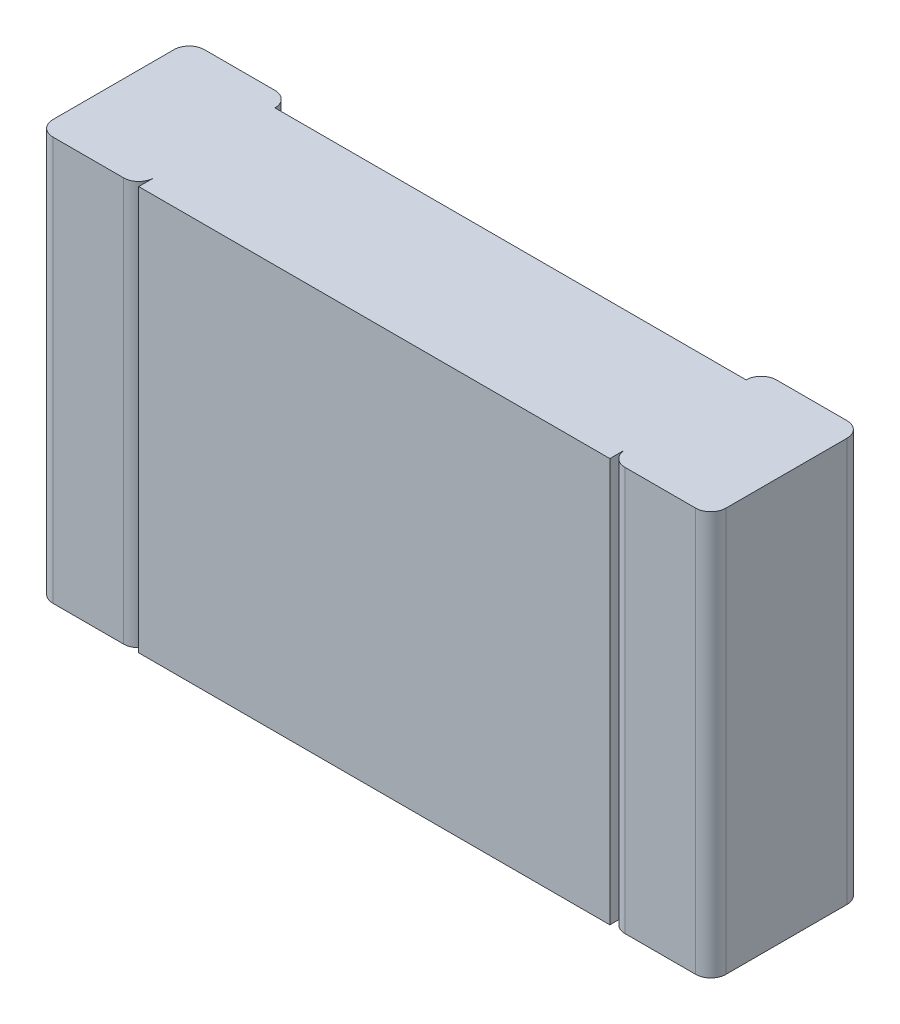
ISO-10303-21;
HEADER;
FILE_DESCRIPTION(('STEP AP214'),'2;1');
FILE_NAME('part.step','',(''),(''),'','','');
FILE_SCHEMA(('AUTOMOTIVE_DESIGN { 1 0 10303 214 1 1 1 1 }'));
ENDSEC;
DATA;
#1=APPLICATION_CONTEXT('core data for automotive mechanical design processes');
#2=APPLICATION_PROTOCOL_DEFINITION('international standard','automotive_design',2000,#1);
#3=PRODUCT_CONTEXT('',#1,'mechanical');
#4=PRODUCT('Part','Part','',(#3));
#5=PRODUCT_RELATED_PRODUCT_CATEGORY('part','',(#4));
#6=PRODUCT_DEFINITION_FORMATION('','',#4);
#7=PRODUCT_DEFINITION_CONTEXT('part definition',#1,'design');
#8=PRODUCT_DEFINITION('design','',#6,#7);
#9=PRODUCT_DEFINITION_SHAPE('','',#8);
#10=(LENGTH_UNIT() NAMED_UNIT(*) SI_UNIT(.MILLI.,.METRE.));
#11=(NAMED_UNIT(*) PLANE_ANGLE_UNIT() SI_UNIT($,.RADIAN.));
#12=(NAMED_UNIT(*) SI_UNIT($,.STERADIAN.) SOLID_ANGLE_UNIT());
#13=UNCERTAINTY_MEASURE_WITH_UNIT(LENGTH_MEASURE(1.E-05),#10,'distance_accuracy_value','');
#14=(GEOMETRIC_REPRESENTATION_CONTEXT(3) GLOBAL_UNCERTAINTY_ASSIGNED_CONTEXT((#13)) GLOBAL_UNIT_ASSIGNED_CONTEXT((#10,
#11,#12)) REPRESENTATION_CONTEXT('',''));
#15=CARTESIAN_POINT('',(0.,0.,0.));
#16=DIRECTION('',(0.,0.,1.));
#17=DIRECTION('',(1.,0.,0.));
#18=AXIS2_PLACEMENT_3D('',#15,#16,#17);
#19=CARTESIAN_POINT('',(-0.955,-0.6,0.045));
#20=DIRECTION('',(0.,1.,0.));
#21=DIRECTION('',(0.,0.,1.));
#22=AXIS2_PLACEMENT_3D('',#19,#20,#21);
#23=CYLINDRICAL_SURFACE('',#22,0.045);
#24=DIRECTION('',(0.,1.,0.));
#25=VECTOR('',#24,1.);
#26=CARTESIAN_POINT('',(-0.955,-0.6,0.));
#27=LINE('',#26,#25);
#28=CARTESIAN_POINT('',(-0.955,0.6,0.));
#29=VERTEX_POINT('',#28);
#30=CARTESIAN_POINT('',(-0.955,-0.6,0.));
#31=VERTEX_POINT('',#30);
#32=EDGE_CURVE('E163',#29,#31,#27,.F.);
#33=ORIENTED_EDGE('',*,*,#32,.T.);
#34=CARTESIAN_POINT('',(-0.955,-0.6,0.045));
#35=DIRECTION('',(0.,1.,0.));
#36=DIRECTION('',(0.,0.,1.));
#37=AXIS2_PLACEMENT_3D('',#34,#35,#36);
#38=CIRCLE('',#37,0.045);
#39=CARTESIAN_POINT('',(-1.,-0.6,0.045));
#40=VERTEX_POINT('',#39);
#41=EDGE_CURVE('E20',#31,#40,#38,.T.);
#42=ORIENTED_EDGE('',*,*,#41,.T.);
#43=DIRECTION('',(0.,1.,0.));
#44=VECTOR('',#43,1.);
#45=CARTESIAN_POINT('',(-1.,-0.6,0.045));
#46=LINE('',#45,#44);
#47=CARTESIAN_POINT('',(-1.,0.6,0.045));
#48=VERTEX_POINT('',#47);
#49=EDGE_CURVE('E170',#40,#48,#46,.T.);
#50=ORIENTED_EDGE('',*,*,#49,.T.);
#51=CARTESIAN_POINT('',(-0.955,0.6,0.045));
#52=DIRECTION('',(0.,1.,0.));
#53=DIRECTION('',(0.,0.,1.));
#54=AXIS2_PLACEMENT_3D('',#51,#52,#53);
#55=CIRCLE('',#54,0.045);
#56=EDGE_CURVE('E296',#29,#48,#55,.T.);
#57=ORIENTED_EDGE('',*,*,#56,.F.);
#58=EDGE_LOOP('',(#33,#42,#50,#57));
#59=FACE_BOUND('',#58,.T.);
#60=ADVANCED_FACE('F17',(#59),#23,.T.);
#61=CARTESIAN_POINT('',(-1.,-0.6,0.));
#62=DIRECTION('',(1.,0.,0.));
#63=DIRECTION('',(0.,0.,-1.));
#64=AXIS2_PLACEMENT_3D('',#61,#62,#63);
#65=PLANE('',#64);
#66=DIRECTION('',(0.,0.,1.));
#67=VECTOR('',#66,1.);
#68=CARTESIAN_POINT('',(-1.,0.6,0.));
#69=LINE('',#68,#67);
#70=CARTESIAN_POINT('',(-1.,0.6,0.405));
#71=VERTEX_POINT('',#70);
#72=EDGE_CURVE('E175',#48,#71,#69,.T.);
#73=ORIENTED_EDGE('',*,*,#72,.F.);
#74=ORIENTED_EDGE('',*,*,#49,.F.);
#75=DIRECTION('',(0.,0.,1.));
#76=VECTOR('',#75,1.);
#77=CARTESIAN_POINT('',(-1.,-0.6,0.));
#78=LINE('',#77,#76);
#79=CARTESIAN_POINT('',(-1.,-0.6,0.405));
#80=VERTEX_POINT('',#79);
#81=EDGE_CURVE('E174',#40,#80,#78,.T.);
#82=ORIENTED_EDGE('',*,*,#81,.T.);
#83=DIRECTION('',(0.,1.,0.));
#84=VECTOR('',#83,1.);
#85=CARTESIAN_POINT('',(-1.,-0.6,0.405));
#86=LINE('',#85,#84);
#87=EDGE_CURVE('E177',#71,#80,#86,.F.);
#88=ORIENTED_EDGE('',*,*,#87,.F.);
#89=EDGE_LOOP('',(#73,#74,#82,#88));
#90=FACE_BOUND('',#89,.T.);
#91=ADVANCED_FACE('F172',(#90),#65,.F.);
#92=CARTESIAN_POINT('',(-0.955,-0.6,0.405));
#93=DIRECTION('',(0.,1.,0.));
#94=DIRECTION('',(0.,0.,1.));
#95=AXIS2_PLACEMENT_3D('',#92,#93,#94);
#96=CYLINDRICAL_SURFACE('',#95,0.045);
#97=CARTESIAN_POINT('',(-0.955,0.6,0.405));
#98=DIRECTION('',(0.,1.,0.));
#99=DIRECTION('',(0.,0.,1.));
#100=AXIS2_PLACEMENT_3D('',#97,#98,#99);
#101=CIRCLE('',#100,0.045);
#102=CARTESIAN_POINT('',(-0.955,0.6,0.45));
#103=VERTEX_POINT('',#102);
#104=EDGE_CURVE('E293',#71,#103,#101,.T.);
#105=ORIENTED_EDGE('',*,*,#104,.F.);
#106=ORIENTED_EDGE('',*,*,#87,.T.);
#107=CARTESIAN_POINT('',(-0.955,-0.6,0.405));
#108=DIRECTION('',(0.,1.,0.));
#109=DIRECTION('',(0.,0.,1.));
#110=AXIS2_PLACEMENT_3D('',#107,#108,#109);
#111=CIRCLE('',#110,0.045);
#112=CARTESIAN_POINT('',(-0.955,-0.6,0.45));
#113=VERTEX_POINT('',#112);
#114=EDGE_CURVE('E186',#80,#113,#111,.T.);
#115=ORIENTED_EDGE('',*,*,#114,.T.);
#116=DIRECTION('',(0.,1.,0.));
#117=VECTOR('',#116,1.);
#118=CARTESIAN_POINT('',(-0.955,-0.6,0.45));
#119=LINE('',#118,#117);
#120=EDGE_CURVE('E252',#103,#113,#119,.F.);
#121=ORIENTED_EDGE('',*,*,#120,.F.);
#122=EDGE_LOOP('',(#105,#106,#115,#121));
#123=FACE_BOUND('',#122,.T.);
#124=ADVANCED_FACE('F545',(#123),#96,.T.);
#125=CARTESIAN_POINT('',(-1.,-0.6,0.45));
#126=DIRECTION('',(0.,0.,1.));
#127=DIRECTION('',(1.,0.,0.));
#128=AXIS2_PLACEMENT_3D('',#125,#126,#127);
#129=PLANE('',#128);
#130=DIRECTION('',(1.,0.,0.));
#131=VECTOR('',#130,1.);
#132=CARTESIAN_POINT('',(-1.,-0.6,0.45));
#133=LINE('',#132,#131);
#134=CARTESIAN_POINT('',(-0.745,-0.6,0.45));
#135=VERTEX_POINT('',#134);
#136=EDGE_CURVE('E317',#113,#135,#133,.T.);
#137=ORIENTED_EDGE('',*,*,#136,.T.);
#138=DIRECTION('',(0.,1.,0.));
#139=VECTOR('',#138,1.);
#140=CARTESIAN_POINT('',(-0.745,-0.6,0.45));
#141=LINE('',#140,#139);
#142=CARTESIAN_POINT('',(-0.745,0.6,0.45));
#143=VERTEX_POINT('',#142);
#144=EDGE_CURVE('E249',#143,#135,#141,.F.);
#145=ORIENTED_EDGE('',*,*,#144,.F.);
#146=DIRECTION('',(1.,0.,0.));
#147=VECTOR('',#146,1.);
#148=CARTESIAN_POINT('',(-1.,0.6,0.45));
#149=LINE('',#148,#147);
#150=EDGE_CURVE('E292',#103,#143,#149,.T.);
#151=ORIENTED_EDGE('',*,*,#150,.F.);
#152=ORIENTED_EDGE('',*,*,#120,.T.);
#153=EDGE_LOOP('',(#137,#145,#151,#152));
#154=FACE_BOUND('',#153,.T.);
#155=ADVANCED_FACE('F535',(#154),#129,.T.);
#156=CARTESIAN_POINT('',(-0.745,-0.6,0.405));
#157=DIRECTION('',(0.,1.,0.));
#158=DIRECTION('',(0.,0.,1.));
#159=AXIS2_PLACEMENT_3D('',#156,#157,#158);
#160=CYLINDRICAL_SURFACE('',#159,0.045);
#161=ORIENTED_EDGE('',*,*,#144,.T.);
#162=CARTESIAN_POINT('',(-0.745,-0.6,0.405));
#163=DIRECTION('',(0.,1.,0.));
#164=DIRECTION('',(0.,0.,1.));
#165=AXIS2_PLACEMENT_3D('',#162,#163,#164);
#166=CIRCLE('',#165,0.045);
#167=CARTESIAN_POINT('',(-0.7,-0.6,0.405));
#168=VERTEX_POINT('',#167);
#169=EDGE_CURVE('E314',#135,#168,#166,.T.);
#170=ORIENTED_EDGE('',*,*,#169,.T.);
#171=DIRECTION('',(0.,1.,0.));
#172=VECTOR('',#171,1.);
#173=CARTESIAN_POINT('',(-0.7,-0.6,0.405));
#174=LINE('',#173,#172);
#175=CARTESIAN_POINT('',(-0.7,0.6,0.405));
#176=VERTEX_POINT('',#175);
#177=EDGE_CURVE('E243',#168,#176,#174,.T.);
#178=ORIENTED_EDGE('',*,*,#177,.T.);
#179=CARTESIAN_POINT('',(-0.745,0.6,0.405));
#180=DIRECTION('',(0.,1.,0.));
#181=DIRECTION('',(0.,0.,1.));
#182=AXIS2_PLACEMENT_3D('',#179,#180,#181);
#183=CIRCLE('',#182,0.045);
#184=EDGE_CURVE('E289',#143,#176,#183,.T.);
#185=ORIENTED_EDGE('',*,*,#184,.F.);
#186=EDGE_LOOP('',(#161,#170,#178,#185));
#187=FACE_BOUND('',#186,.T.);
#188=ADVANCED_FACE('F523',(#187),#160,.T.);
#189=CARTESIAN_POINT('',(-0.7,-0.6,0.405));
#190=DIRECTION('',(1.,0.,0.));
#191=DIRECTION('',(0.,0.,-1.));
#192=AXIS2_PLACEMENT_3D('',#189,#190,#191);
#193=PLANE('',#192);
#194=DIRECTION('',(0.,0.,1.));
#195=VECTOR('',#194,1.);
#196=CARTESIAN_POINT('',(-0.7,0.6,0.405));
#197=LINE('',#196,#195);
#198=CARTESIAN_POINT('',(-0.7,0.6,0.45));
#199=VERTEX_POINT('',#198);
#200=EDGE_CURVE('E237',#176,#199,#197,.T.);
#201=ORIENTED_EDGE('',*,*,#200,.F.);
#202=ORIENTED_EDGE('',*,*,#177,.F.);
#203=DIRECTION('',(0.,0.,1.));
#204=VECTOR('',#203,1.);
#205=CARTESIAN_POINT('',(-0.7,-0.6,0.405));
#206=LINE('',#205,#204);
#207=CARTESIAN_POINT('',(-0.7,-0.6,0.45));
#208=VERTEX_POINT('',#207);
#209=EDGE_CURVE('E261',#168,#208,#206,.T.);
#210=ORIENTED_EDGE('',*,*,#209,.T.);
#211=DIRECTION('',(0.,1.,0.));
#212=VECTOR('',#211,1.);
#213=CARTESIAN_POINT('',(-0.7,-0.6,0.45));
#214=LINE('',#213,#212);
#215=EDGE_CURVE('E229',#199,#208,#214,.F.);
#216=ORIENTED_EDGE('',*,*,#215,.F.);
#217=EDGE_LOOP('',(#201,#202,#210,#216));
#218=FACE_BOUND('',#217,.T.);
#219=ADVANCED_FACE('F513',(#218),#193,.F.);
#220=CARTESIAN_POINT('',(-0.7,-0.6,0.45));
#221=DIRECTION('',(0.,0.,1.));
#222=DIRECTION('',(1.,0.,0.));
#223=AXIS2_PLACEMENT_3D('',#220,#221,#222);
#224=PLANE('',#223);
#225=DIRECTION('',(0.,1.,0.));
#226=VECTOR('',#225,1.);
#227=CARTESIAN_POINT('',(0.7,-0.6,0.45));
#228=LINE('',#227,#226);
#229=CARTESIAN_POINT('',(0.7,0.6,0.45));
#230=VERTEX_POINT('',#229);
#231=CARTESIAN_POINT('',(0.7,-0.6,0.45));
#232=VERTEX_POINT('',#231);
#233=EDGE_CURVE('E220',#230,#232,#228,.F.);
#234=ORIENTED_EDGE('',*,*,#233,.F.);
#235=DIRECTION('',(1.,0.,0.));
#236=VECTOR('',#235,1.);
#237=CARTESIAN_POINT('',(-0.7,0.6,0.45));
#238=LINE('',#237,#236);
#239=EDGE_CURVE('E232',#199,#230,#238,.T.);
#240=ORIENTED_EDGE('',*,*,#239,.F.);
#241=ORIENTED_EDGE('',*,*,#215,.T.);
#242=DIRECTION('',(1.,0.,0.));
#243=VECTOR('',#242,1.);
#244=CARTESIAN_POINT('',(-0.7,-0.6,0.45));
#245=LINE('',#244,#243);
#246=EDGE_CURVE('E257',#208,#232,#245,.T.);
#247=ORIENTED_EDGE('',*,*,#246,.T.);
#248=EDGE_LOOP('',(#234,#240,#241,#247));
#249=FACE_BOUND('',#248,.T.);
#250=ADVANCED_FACE('F500',(#249),#224,.T.);
#251=CARTESIAN_POINT('',(0.7,-0.6,0.405));
#252=DIRECTION('',(1.,0.,0.));
#253=DIRECTION('',(0.,0.,-1.));
#254=AXIS2_PLACEMENT_3D('',#251,#252,#253);
#255=PLANE('',#254);
#256=DIRECTION('',(0.,0.,1.));
#257=VECTOR('',#256,1.);
#258=CARTESIAN_POINT('',(0.7,0.6,0.405));
#259=LINE('',#258,#257);
#260=CARTESIAN_POINT('',(0.7,0.6,0.405));
#261=VERTEX_POINT('',#260);
#262=EDGE_CURVE('E236',#230,#261,#259,.F.);
#263=ORIENTED_EDGE('',*,*,#262,.F.);
#264=ORIENTED_EDGE('',*,*,#233,.T.);
#265=DIRECTION('',(0.,0.,1.));
#266=VECTOR('',#265,1.);
#267=CARTESIAN_POINT('',(0.7,-0.6,0.405));
#268=LINE('',#267,#266);
#269=CARTESIAN_POINT('',(0.7,-0.6,0.405));
#270=VERTEX_POINT('',#269);
#271=EDGE_CURVE('E225',#232,#270,#268,.F.);
#272=ORIENTED_EDGE('',*,*,#271,.T.);
#273=DIRECTION('',(0.,1.,0.));
#274=VECTOR('',#273,1.);
#275=CARTESIAN_POINT('',(0.7,-0.6,0.405));
#276=LINE('',#275,#274);
#277=EDGE_CURVE('E217',#261,#270,#276,.F.);
#278=ORIENTED_EDGE('',*,*,#277,.F.);
#279=EDGE_LOOP('',(#263,#264,#272,#278));
#280=FACE_BOUND('',#279,.T.);
#281=ADVANCED_FACE('F468',(#280),#255,.T.);
#282=CARTESIAN_POINT('',(0.745,-0.6,0.405));
#283=DIRECTION('',(0.,1.,0.));
#284=DIRECTION('',(0.,0.,1.));
#285=AXIS2_PLACEMENT_3D('',#282,#283,#284);
#286=CYLINDRICAL_SURFACE('',#285,0.045);
#287=CARTESIAN_POINT('',(0.745,0.6,0.405));
#288=DIRECTION('',(0.,1.,0.));
#289=DIRECTION('',(0.,0.,1.));
#290=AXIS2_PLACEMENT_3D('',#287,#288,#289);
#291=CIRCLE('',#290,0.045);
#292=CARTESIAN_POINT('',(0.745,0.6,0.45));
#293=VERTEX_POINT('',#292);
#294=EDGE_CURVE('E285',#261,#293,#291,.T.);
#295=ORIENTED_EDGE('',*,*,#294,.F.);
#296=ORIENTED_EDGE('',*,*,#277,.T.);
#297=CARTESIAN_POINT('',(0.745,-0.6,0.405));
#298=DIRECTION('',(0.,1.,0.));
#299=DIRECTION('',(0.,0.,1.));
#300=AXIS2_PLACEMENT_3D('',#297,#298,#299);
#301=CIRCLE('',#300,0.045);
#302=CARTESIAN_POINT('',(0.745,-0.6,0.45));
#303=VERTEX_POINT('',#302);
#304=EDGE_CURVE('E310',#270,#303,#301,.T.);
#305=ORIENTED_EDGE('',*,*,#304,.T.);
#306=DIRECTION('',(0.,1.,0.));
#307=VECTOR('',#306,1.);
#308=CARTESIAN_POINT('',(0.745,-0.6,0.45));
#309=LINE('',#308,#307);
#310=EDGE_CURVE('E214',#293,#303,#309,.F.);
#311=ORIENTED_EDGE('',*,*,#310,.F.);
#312=EDGE_LOOP('',(#295,#296,#305,#311));
#313=FACE_BOUND('',#312,.T.);
#314=ADVANCED_FACE('F499',(#313),#286,.T.);
#315=CARTESIAN_POINT('',(0.7,-0.6,0.45));
#316=DIRECTION('',(0.,0.,1.));
#317=DIRECTION('',(1.,0.,0.));
#318=AXIS2_PLACEMENT_3D('',#315,#316,#317);
#319=PLANE('',#318);
#320=DIRECTION('',(1.,0.,0.));
#321=VECTOR('',#320,1.);
#322=CARTESIAN_POINT('',(0.7,-0.6,0.45));
#323=LINE('',#322,#321);
#324=CARTESIAN_POINT('',(0.955,-0.6,0.45));
#325=VERTEX_POINT('',#324);
#326=EDGE_CURVE('E309',#303,#325,#323,.T.);
#327=ORIENTED_EDGE('',*,*,#326,.T.);
#328=DIRECTION('',(0.,1.,0.));
#329=VECTOR('',#328,1.);
#330=CARTESIAN_POINT('',(0.955,-0.6,0.45));
#331=LINE('',#330,#329);
#332=CARTESIAN_POINT('',(0.955,0.6,0.45));
#333=VERTEX_POINT('',#332);
#334=EDGE_CURVE('E211',#333,#325,#331,.F.);
#335=ORIENTED_EDGE('',*,*,#334,.F.);
#336=DIRECTION('',(1.,0.,0.));
#337=VECTOR('',#336,1.);
#338=CARTESIAN_POINT('',(0.7,0.6,0.45));
#339=LINE('',#338,#337);
#340=EDGE_CURVE('E284',#293,#333,#339,.T.);
#341=ORIENTED_EDGE('',*,*,#340,.F.);
#342=ORIENTED_EDGE('',*,*,#310,.T.);
#343=EDGE_LOOP('',(#327,#335,#341,#342));
#344=FACE_BOUND('',#343,.T.);
#345=ADVANCED_FACE('F613',(#344),#319,.T.);
#346=CARTESIAN_POINT('',(0.955,-0.6,0.405));
#347=DIRECTION('',(0.,1.,0.));
#348=DIRECTION('',(0.,0.,1.));
#349=AXIS2_PLACEMENT_3D('',#346,#347,#348);
#350=CYLINDRICAL_SURFACE('',#349,0.045);
#351=ORIENTED_EDGE('',*,*,#334,.T.);
#352=CARTESIAN_POINT('',(0.955,-0.6,0.405));
#353=DIRECTION('',(0.,1.,0.));
#354=DIRECTION('',(0.,0.,1.));
#355=AXIS2_PLACEMENT_3D('',#352,#353,#354);
#356=CIRCLE('',#355,0.045);
#357=CARTESIAN_POINT('',(1.,-0.6,0.405));
#358=VERTEX_POINT('',#357);
#359=EDGE_CURVE('E305',#325,#358,#356,.T.);
#360=ORIENTED_EDGE('',*,*,#359,.T.);
#361=DIRECTION('',(0.,1.,0.));
#362=VECTOR('',#361,1.);
#363=CARTESIAN_POINT('',(1.,-0.6,0.405));
#364=LINE('',#363,#362);
#365=CARTESIAN_POINT('',(1.,0.6,0.405));
#366=VERTEX_POINT('',#365);
#367=EDGE_CURVE('E208',#366,#358,#364,.F.);
#368=ORIENTED_EDGE('',*,*,#367,.F.);
#369=CARTESIAN_POINT('',(0.955,0.6,0.405));
#370=DIRECTION('',(0.,1.,0.));
#371=DIRECTION('',(0.,0.,1.));
#372=AXIS2_PLACEMENT_3D('',#369,#370,#371);
#373=CIRCLE('',#372,0.045);
#374=EDGE_CURVE('E281',#333,#366,#373,.T.);
#375=ORIENTED_EDGE('',*,*,#374,.F.);
#376=EDGE_LOOP('',(#351,#360,#368,#375));
#377=FACE_BOUND('',#376,.T.);
#378=ADVANCED_FACE('F576',(#377),#350,.T.);
#379=CARTESIAN_POINT('',(1.,-0.6,0.));
#380=DIRECTION('',(1.,0.,0.));
#381=DIRECTION('',(0.,0.,-1.));
#382=AXIS2_PLACEMENT_3D('',#379,#380,#381);
#383=PLANE('',#382);
#384=DIRECTION('',(0.,0.,1.));
#385=VECTOR('',#384,1.);
#386=CARTESIAN_POINT('',(1.,0.6,0.));
#387=LINE('',#386,#385);
#388=CARTESIAN_POINT('',(1.,0.6,0.045));
#389=VERTEX_POINT('',#388);
#390=EDGE_CURVE('E280',#366,#389,#387,.F.);
#391=ORIENTED_EDGE('',*,*,#390,.F.);
#392=ORIENTED_EDGE('',*,*,#367,.T.);
#393=DIRECTION('',(0.,0.,1.));
#394=VECTOR('',#393,1.);
#395=CARTESIAN_POINT('',(1.,-0.6,0.));
#396=LINE('',#395,#394);
#397=CARTESIAN_POINT('',(1.,-0.6,0.045));
#398=VERTEX_POINT('',#397);
#399=EDGE_CURVE('E304',#358,#398,#396,.F.);
#400=ORIENTED_EDGE('',*,*,#399,.T.);
#401=DIRECTION('',(0.,1.,0.));
#402=VECTOR('',#401,1.);
#403=CARTESIAN_POINT('',(1.,-0.6,0.045));
#404=LINE('',#403,#402);
#405=EDGE_CURVE('E198',#389,#398,#404,.F.);
#406=ORIENTED_EDGE('',*,*,#405,.F.);
#407=EDGE_LOOP('',(#391,#392,#400,#406));
#408=FACE_BOUND('',#407,.T.);
#409=ADVANCED_FACE('F386',(#408),#383,.T.);
#410=CARTESIAN_POINT('',(0.955,-0.6,0.045));
#411=DIRECTION('',(0.,1.,0.));
#412=DIRECTION('',(0.,0.,1.));
#413=AXIS2_PLACEMENT_3D('',#410,#411,#412);
#414=CYLINDRICAL_SURFACE('',#413,0.045);
#415=CARTESIAN_POINT('',(0.955,0.6,0.045));
#416=DIRECTION('',(0.,1.,0.));
#417=DIRECTION('',(0.,0.,1.));
#418=AXIS2_PLACEMENT_3D('',#415,#416,#417);
#419=CIRCLE('',#418,0.045);
#420=CARTESIAN_POINT('',(0.955,0.6,0.));
#421=VERTEX_POINT('',#420);
#422=EDGE_CURVE('E276',#389,#421,#419,.T.);
#423=ORIENTED_EDGE('',*,*,#422,.F.);
#424=ORIENTED_EDGE('',*,*,#405,.T.);
#425=CARTESIAN_POINT('',(0.955,-0.6,0.045));
#426=DIRECTION('',(0.,1.,0.));
#427=DIRECTION('',(0.,0.,1.));
#428=AXIS2_PLACEMENT_3D('',#425,#426,#427);
#429=CIRCLE('',#428,0.045);
#430=CARTESIAN_POINT('',(0.955,-0.6,0.));
#431=VERTEX_POINT('',#430);
#432=EDGE_CURVE('E300',#398,#431,#429,.T.);
#433=ORIENTED_EDGE('',*,*,#432,.T.);
#434=DIRECTION('',(0.,1.,0.));
#435=VECTOR('',#434,1.);
#436=CARTESIAN_POINT('',(0.955,-0.6,0.));
#437=LINE('',#436,#435);
#438=EDGE_CURVE('E221',#431,#421,#437,.T.);
#439=ORIENTED_EDGE('',*,*,#438,.T.);
#440=EDGE_LOOP('',(#423,#424,#433,#439));
#441=FACE_BOUND('',#440,.T.);
#442=ADVANCED_FACE('F390',(#441),#414,.T.);
#443=CARTESIAN_POINT('',(-1.,-0.6,0.));
#444=DIRECTION('',(0.,0.,1.));
#445=DIRECTION('',(1.,0.,0.));
#446=AXIS2_PLACEMENT_3D('',#443,#444,#445);
#447=PLANE('',#446);
#448=DIRECTION('',(1.,0.,0.));
#449=VECTOR('',#448,1.);
#450=CARTESIAN_POINT('',(-1.,-0.6,0.));
#451=LINE('',#450,#449);
#452=CARTESIAN_POINT('',(-0.745,-0.6,0.));
#453=VERTEX_POINT('',#452);
#454=EDGE_CURVE('E190',#453,#31,#451,.F.);
#455=ORIENTED_EDGE('',*,*,#454,.T.);
#456=ORIENTED_EDGE('',*,*,#32,.F.);
#457=DIRECTION('',(1.,0.,0.));
#458=VECTOR('',#457,1.);
#459=CARTESIAN_POINT('',(-1.,0.6,0.));
#460=LINE('',#459,#458);
#461=CARTESIAN_POINT('',(-0.745,0.6,0.));
#462=VERTEX_POINT('',#461);
#463=EDGE_CURVE('E299',#462,#29,#460,.F.);
#464=ORIENTED_EDGE('',*,*,#463,.F.);
#465=DIRECTION('',(0.,1.,0.));
#466=VECTOR('',#465,1.);
#467=CARTESIAN_POINT('',(-0.745,-0.6,0.));
#468=LINE('',#467,#466);
#469=EDGE_CURVE('E202',#453,#462,#468,.T.);
#470=ORIENTED_EDGE('',*,*,#469,.F.);
#471=EDGE_LOOP('',(#455,#456,#464,#470));
#472=FACE_BOUND('',#471,.T.);
#473=ADVANCED_FACE('F408',(#472),#447,.F.);
#474=CARTESIAN_POINT('',(0.7,-0.6,0.));
#475=DIRECTION('',(0.,0.,1.));
#476=DIRECTION('',(1.,0.,0.));
#477=AXIS2_PLACEMENT_3D('',#474,#475,#476);
#478=PLANE('',#477);
#479=DIRECTION('',(1.,0.,0.));
#480=VECTOR('',#479,1.);
#481=CARTESIAN_POINT('',(0.7,-0.6,0.));
#482=LINE('',#481,#480);
#483=CARTESIAN_POINT('',(0.745,-0.6,0.));
#484=VERTEX_POINT('',#483);
#485=EDGE_CURVE('E224',#431,#484,#482,.F.);
#486=ORIENTED_EDGE('',*,*,#485,.T.);
#487=DIRECTION('',(0.,1.,0.));
#488=VECTOR('',#487,1.);
#489=CARTESIAN_POINT('',(0.745,-0.6,0.));
#490=LINE('',#489,#488);
#491=CARTESIAN_POINT('',(0.745,0.6,0.));
#492=VERTEX_POINT('',#491);
#493=EDGE_CURVE('E268',#492,#484,#490,.F.);
#494=ORIENTED_EDGE('',*,*,#493,.F.);
#495=DIRECTION('',(1.,0.,0.));
#496=VECTOR('',#495,1.);
#497=CARTESIAN_POINT('',(0.7,0.6,0.));
#498=LINE('',#497,#496);
#499=EDGE_CURVE('E288',#421,#492,#498,.F.);
#500=ORIENTED_EDGE('',*,*,#499,.F.);
#501=ORIENTED_EDGE('',*,*,#438,.F.);
#502=EDGE_LOOP('',(#486,#494,#500,#501));
#503=FACE_BOUND('',#502,.T.);
#504=ADVANCED_FACE('F393',(#503),#478,.F.);
#505=CARTESIAN_POINT('',(-0.745,-0.6,0.045));
#506=DIRECTION('',(0.,1.,0.));
#507=DIRECTION('',(0.,0.,1.));
#508=AXIS2_PLACEMENT_3D('',#505,#506,#507);
#509=CYLINDRICAL_SURFACE('',#508,0.045);
#510=CARTESIAN_POINT('',(-0.745,0.6,0.045));
#511=DIRECTION('',(0.,1.,0.));
#512=DIRECTION('',(0.,0.,1.));
#513=AXIS2_PLACEMENT_3D('',#510,#511,#512);
#514=CIRCLE('',#513,0.045);
#515=CARTESIAN_POINT('',(-0.7,0.6,0.045));
#516=VERTEX_POINT('',#515);
#517=EDGE_CURVE('E204',#462,#516,#514,.F.);
#518=ORIENTED_EDGE('',*,*,#517,.T.);
#519=DIRECTION('',(0.,1.,0.));
#520=VECTOR('',#519,1.);
#521=CARTESIAN_POINT('',(-0.7,-0.6,0.045));
#522=LINE('',#521,#520);
#523=CARTESIAN_POINT('',(-0.7,-0.6,0.045));
#524=VERTEX_POINT('',#523);
#525=EDGE_CURVE('E267',#516,#524,#522,.F.);
#526=ORIENTED_EDGE('',*,*,#525,.T.);
#527=CARTESIAN_POINT('',(-0.745,-0.6,0.045));
#528=DIRECTION('',(0.,1.,0.));
#529=DIRECTION('',(0.,0.,1.));
#530=AXIS2_PLACEMENT_3D('',#527,#528,#529);
#531=CIRCLE('',#530,0.045);
#532=EDGE_CURVE('E205',#524,#453,#531,.T.);
#533=ORIENTED_EDGE('',*,*,#532,.T.);
#534=ORIENTED_EDGE('',*,*,#469,.T.);
#535=EDGE_LOOP('',(#518,#526,#533,#534));
#536=FACE_BOUND('',#535,.T.);
#537=ADVANCED_FACE('F407',(#536),#509,.T.);
#538=CARTESIAN_POINT('',(-0.955,-0.6,0.045));
#539=DIRECTION('',(0.,1.,0.));
#540=DIRECTION('',(0.,0.,1.));
#541=AXIS2_PLACEMENT_3D('',#538,#539,#540);
#542=PLANE('',#541);
#543=DIRECTION('',(1.,0.,0.));
#544=VECTOR('',#543,1.);
#545=CARTESIAN_POINT('',(-0.955,-0.6,0.045));
#546=LINE('',#545,#544);
#547=CARTESIAN_POINT('',(0.7,-0.6,0.045));
#548=VERTEX_POINT('',#547);
#549=EDGE_CURVE('E336',#524,#548,#546,.T.);
#550=ORIENTED_EDGE('',*,*,#549,.T.);
#551=CARTESIAN_POINT('',(0.745,-0.6,0.045));
#552=DIRECTION('',(0.,1.,0.));
#553=DIRECTION('',(0.,0.,1.));
#554=AXIS2_PLACEMENT_3D('',#551,#552,#553);
#555=CIRCLE('',#554,0.045);
#556=EDGE_CURVE('E264',#484,#548,#555,.T.);
#557=ORIENTED_EDGE('',*,*,#556,.F.);
#558=ORIENTED_EDGE('',*,*,#485,.F.);
#559=ORIENTED_EDGE('',*,*,#432,.F.);
#560=ORIENTED_EDGE('',*,*,#399,.F.);
#561=ORIENTED_EDGE('',*,*,#359,.F.);
#562=ORIENTED_EDGE('',*,*,#326,.F.);
#563=ORIENTED_EDGE('',*,*,#304,.F.);
#564=ORIENTED_EDGE('',*,*,#271,.F.);
#565=ORIENTED_EDGE('',*,*,#246,.F.);
#566=ORIENTED_EDGE('',*,*,#209,.F.);
#567=ORIENTED_EDGE('',*,*,#169,.F.);
#568=ORIENTED_EDGE('',*,*,#136,.F.);
#569=ORIENTED_EDGE('',*,*,#114,.F.);
#570=ORIENTED_EDGE('',*,*,#81,.F.);
#571=ORIENTED_EDGE('',*,*,#41,.F.);
#572=ORIENTED_EDGE('',*,*,#454,.F.);
#573=ORIENTED_EDGE('',*,*,#532,.F.);
#574=EDGE_LOOP('',(#550,#557,#558,#559,#560,#561,#562,#563,#564,#565,#566,#567,#568,#569,#570,
#571,#572,#573));
#575=FACE_BOUND('',#574,.T.);
#576=ADVANCED_FACE('F182',(#575),#542,.F.);
#577=CARTESIAN_POINT('',(0.745,-0.6,0.045));
#578=DIRECTION('',(0.,1.,0.));
#579=DIRECTION('',(0.,0.,1.));
#580=AXIS2_PLACEMENT_3D('',#577,#578,#579);
#581=CYLINDRICAL_SURFACE('',#580,0.045);
#582=ORIENTED_EDGE('',*,*,#493,.T.);
#583=ORIENTED_EDGE('',*,*,#556,.T.);
#584=DIRECTION('',(0.,1.,0.));
#585=VECTOR('',#584,1.);
#586=CARTESIAN_POINT('',(0.7,-0.6,0.045));
#587=LINE('',#586,#585);
#588=CARTESIAN_POINT('',(0.7,0.6,0.045));
#589=VERTEX_POINT('',#588);
#590=EDGE_CURVE('E27',#548,#589,#587,.T.);
#591=ORIENTED_EDGE('',*,*,#590,.T.);
#592=CARTESIAN_POINT('',(0.745,0.6,0.045));
#593=DIRECTION('',(0.,1.,0.));
#594=DIRECTION('',(0.,0.,1.));
#595=AXIS2_PLACEMENT_3D('',#592,#593,#594);
#596=CIRCLE('',#595,0.045);
#597=EDGE_CURVE('E39',#589,#492,#596,.F.);
#598=ORIENTED_EDGE('',*,*,#597,.T.);
#599=EDGE_LOOP('',(#582,#583,#591,#598));
#600=FACE_BOUND('',#599,.T.);
#601=ADVANCED_FACE('F400',(#600),#581,.T.);
#602=CARTESIAN_POINT('',(-0.955,0.6,0.045));
#603=DIRECTION('',(0.,1.,0.));
#604=DIRECTION('',(0.,0.,1.));
#605=AXIS2_PLACEMENT_3D('',#602,#603,#604);
#606=PLANE('',#605);
#607=DIRECTION('',(1.,0.,0.));
#608=VECTOR('',#607,1.);
#609=CARTESIAN_POINT('',(-0.955,0.6,0.045));
#610=LINE('',#609,#608);
#611=EDGE_CURVE('E11',#589,#516,#610,.F.);
#612=ORIENTED_EDGE('',*,*,#611,.T.);
#613=ORIENTED_EDGE('',*,*,#517,.F.);
#614=ORIENTED_EDGE('',*,*,#463,.T.);
#615=ORIENTED_EDGE('',*,*,#56,.T.);
#616=ORIENTED_EDGE('',*,*,#72,.T.);
#617=ORIENTED_EDGE('',*,*,#104,.T.);
#618=ORIENTED_EDGE('',*,*,#150,.T.);
#619=ORIENTED_EDGE('',*,*,#184,.T.);
#620=ORIENTED_EDGE('',*,*,#200,.T.);
#621=ORIENTED_EDGE('',*,*,#239,.T.);
#622=ORIENTED_EDGE('',*,*,#262,.T.);
#623=ORIENTED_EDGE('',*,*,#294,.T.);
#624=ORIENTED_EDGE('',*,*,#340,.T.);
#625=ORIENTED_EDGE('',*,*,#374,.T.);
#626=ORIENTED_EDGE('',*,*,#390,.T.);
#627=ORIENTED_EDGE('',*,*,#422,.T.);
#628=ORIENTED_EDGE('',*,*,#499,.T.);
#629=ORIENTED_EDGE('',*,*,#597,.F.);
#630=EDGE_LOOP('',(#612,#613,#614,#615,#616,#617,#618,#619,#620,#621,#622,#623,#624,#625,#626,
#627,#628,#629));
#631=FACE_BOUND('',#630,.T.);
#632=ADVANCED_FACE('F380',(#631),#606,.T.);
#633=CARTESIAN_POINT('',(-0.955,-0.6,0.045));
#634=DIRECTION('',(0.,0.,1.));
#635=DIRECTION('',(1.,0.,0.));
#636=AXIS2_PLACEMENT_3D('',#633,#634,#635);
#637=PLANE('',#636);
#638=ORIENTED_EDGE('',*,*,#590,.F.);
#639=ORIENTED_EDGE('',*,*,#549,.F.);
#640=ORIENTED_EDGE('',*,*,#525,.F.);
#641=ORIENTED_EDGE('',*,*,#611,.F.);
#642=EDGE_LOOP('',(#638,#639,#640,#641));
#643=FACE_BOUND('',#642,.T.);
#644=ADVANCED_FACE('F402',(#643),#637,.F.);
#645=CLOSED_SHELL('',(#60,#91,#124,#155,#188,#219,#250,#281,#314,#345,#378,#409,#442,#473,#504,
#537,#576,#601,#632,#644));
#646=MANIFOLD_SOLID_BREP('B1',#645);
#647=ADVANCED_BREP_SHAPE_REPRESENTATION('',(#18,#646),#14);
#648=SHAPE_DEFINITION_REPRESENTATION(#9,#647);
ENDSEC;
END-ISO-10303-21;
